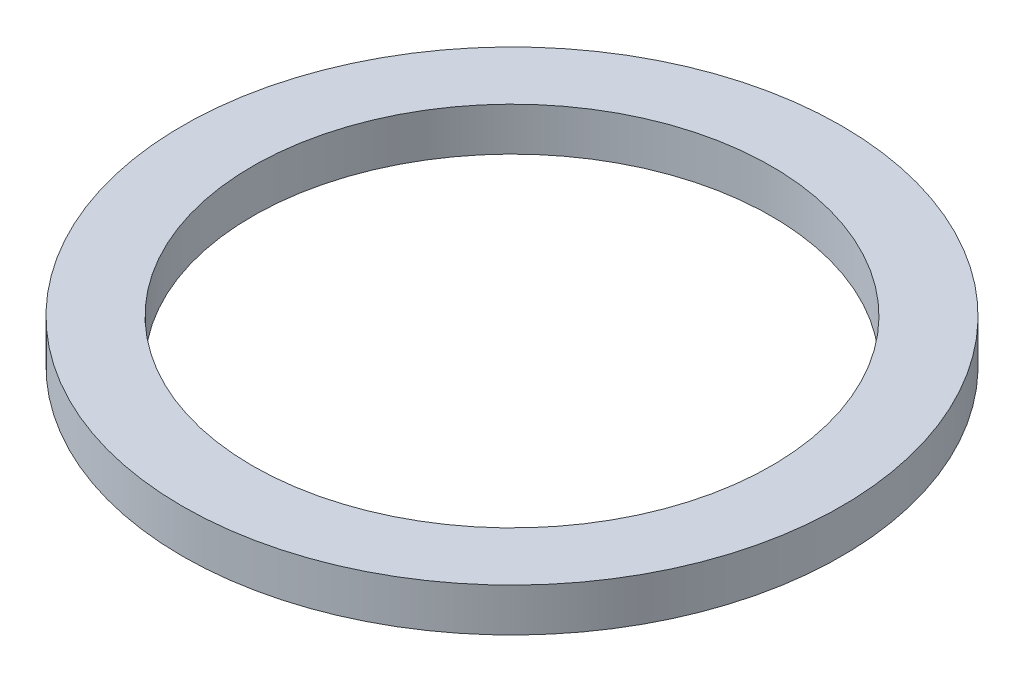
ISO-10303-21;
HEADER;
FILE_DESCRIPTION(('STEP AP214'),'2;1');
FILE_NAME('part.step','',(''),(''),'','','');
FILE_SCHEMA(('AUTOMOTIVE_DESIGN { 1 0 10303 214 1 1 1 1 }'));
ENDSEC;
DATA;
#1=APPLICATION_CONTEXT('core data for automotive mechanical design processes');
#2=APPLICATION_PROTOCOL_DEFINITION('international standard','automotive_design',2000,#1);
#3=PRODUCT_CONTEXT('',#1,'mechanical');
#4=PRODUCT('Part','Part','',(#3));
#5=PRODUCT_RELATED_PRODUCT_CATEGORY('part','',(#4));
#6=PRODUCT_DEFINITION_FORMATION('','',#4);
#7=PRODUCT_DEFINITION_CONTEXT('part definition',#1,'design');
#8=PRODUCT_DEFINITION('design','',#6,#7);
#9=PRODUCT_DEFINITION_SHAPE('','',#8);
#10=(LENGTH_UNIT() NAMED_UNIT(*) SI_UNIT(.MILLI.,.METRE.));
#11=(NAMED_UNIT(*) PLANE_ANGLE_UNIT() SI_UNIT($,.RADIAN.));
#12=(NAMED_UNIT(*) SI_UNIT($,.STERADIAN.) SOLID_ANGLE_UNIT());
#13=UNCERTAINTY_MEASURE_WITH_UNIT(LENGTH_MEASURE(1.E-05),#10,'distance_accuracy_value','');
#14=(GEOMETRIC_REPRESENTATION_CONTEXT(3) GLOBAL_UNCERTAINTY_ASSIGNED_CONTEXT((#13)) GLOBAL_UNIT_ASSIGNED_CONTEXT((#10,
#11,#12)) REPRESENTATION_CONTEXT('',''));
#15=CARTESIAN_POINT('',(0.,0.,0.));
#16=DIRECTION('',(0.,0.,1.));
#17=DIRECTION('',(1.,0.,0.));
#18=AXIS2_PLACEMENT_3D('',#15,#16,#17);
#19=CARTESIAN_POINT('',(15.,0.,0.));
#20=DIRECTION('',(0.,1.,0.));
#21=DIRECTION('',(0.,0.,1.));
#22=AXIS2_PLACEMENT_3D('',#19,#20,#21);
#23=PLANE('',#22);
#24=CARTESIAN_POINT('',(0.,0.,0.));
#25=DIRECTION('',(0.,1.,0.));
#26=DIRECTION('',(0.,0.,1.));
#27=AXIS2_PLACEMENT_3D('',#24,#25,#26);
#28=CIRCLE('',#27,19.05);
#29=CARTESIAN_POINT('',(0.,0.,19.05));
#30=VERTEX_POINT('',#29);
#31=EDGE_CURVE('E10',#30,#30,#28,.T.);
#32=ORIENTED_EDGE('',*,*,#31,.F.);
#33=EDGE_LOOP('',(#32));
#34=FACE_BOUND('',#33,.T.);
#35=CARTESIAN_POINT('',(0.,0.,0.));
#36=DIRECTION('',(0.,1.,0.));
#37=DIRECTION('',(0.,0.,1.));
#38=AXIS2_PLACEMENT_3D('',#35,#36,#37);
#39=CIRCLE('',#38,15.);
#40=CARTESIAN_POINT('',(0.,0.,15.));
#41=VERTEX_POINT('',#40);
#42=EDGE_CURVE('E51',#41,#41,#39,.T.);
#43=ORIENTED_EDGE('',*,*,#42,.T.);
#44=EDGE_LOOP('',(#43));
#45=FACE_BOUND('',#44,.T.);
#46=ADVANCED_FACE('F37',(#34,#45),#23,.F.);
#47=CARTESIAN_POINT('',(0.,77.1441422656178,0.));
#48=DIRECTION('',(0.,1.,0.));
#49=DIRECTION('',(0.,0.,1.));
#50=AXIS2_PLACEMENT_3D('',#47,#48,#49);
#51=CYLINDRICAL_SURFACE('',#50,19.05);
#52=CARTESIAN_POINT('',(0.,2.5,0.));
#53=DIRECTION('',(0.,1.,0.));
#54=DIRECTION('',(0.,0.,1.));
#55=AXIS2_PLACEMENT_3D('',#52,#53,#54);
#56=CIRCLE('',#55,19.05);
#57=CARTESIAN_POINT('',(0.,2.5,19.05));
#58=VERTEX_POINT('',#57);
#59=EDGE_CURVE('E43',#58,#58,#56,.T.);
#60=ORIENTED_EDGE('',*,*,#59,.F.);
#61=EDGE_LOOP('',(#60));
#62=FACE_BOUND('',#61,.T.);
#63=ORIENTED_EDGE('',*,*,#31,.T.);
#64=EDGE_LOOP('',(#63));
#65=FACE_BOUND('',#64,.T.);
#66=ADVANCED_FACE('F66',(#62,#65),#51,.T.);
#67=CARTESIAN_POINT('',(15.,2.5,0.));
#68=DIRECTION('',(0.,-1.,0.));
#69=DIRECTION('',(0.,0.,-1.));
#70=AXIS2_PLACEMENT_3D('',#67,#68,#69);
#71=PLANE('',#70);
#72=CARTESIAN_POINT('',(0.,2.5,0.));
#73=DIRECTION('',(0.,1.,0.));
#74=DIRECTION('',(0.,0.,1.));
#75=AXIS2_PLACEMENT_3D('',#72,#73,#74);
#76=CIRCLE('',#75,15.);
#77=CARTESIAN_POINT('',(0.,2.5,15.));
#78=VERTEX_POINT('',#77);
#79=EDGE_CURVE('E47',#78,#78,#76,.T.);
#80=ORIENTED_EDGE('',*,*,#79,.F.);
#81=EDGE_LOOP('',(#80));
#82=FACE_BOUND('',#81,.T.);
#83=ORIENTED_EDGE('',*,*,#59,.T.);
#84=EDGE_LOOP('',(#83));
#85=FACE_BOUND('',#84,.T.);
#86=ADVANCED_FACE('F61',(#82,#85),#71,.F.);
#87=CARTESIAN_POINT('',(0.,77.1441422656178,0.));
#88=DIRECTION('',(0.,1.,0.));
#89=DIRECTION('',(0.,0.,1.));
#90=AXIS2_PLACEMENT_3D('',#87,#88,#89);
#91=CYLINDRICAL_SURFACE('',#90,15.);
#92=ORIENTED_EDGE('',*,*,#42,.F.);
#93=EDGE_LOOP('',(#92));
#94=FACE_BOUND('',#93,.T.);
#95=ORIENTED_EDGE('',*,*,#79,.T.);
#96=EDGE_LOOP('',(#95));
#97=FACE_BOUND('',#96,.T.);
#98=ADVANCED_FACE('F58',(#94,#97),#91,.F.);
#99=CLOSED_SHELL('',(#46,#66,#86,#98));
#100=MANIFOLD_SOLID_BREP('B2',#99);
#101=ADVANCED_BREP_SHAPE_REPRESENTATION('',(#18,#100),#14);
#102=SHAPE_DEFINITION_REPRESENTATION(#9,#101);
ENDSEC;
END-ISO-10303-21;
